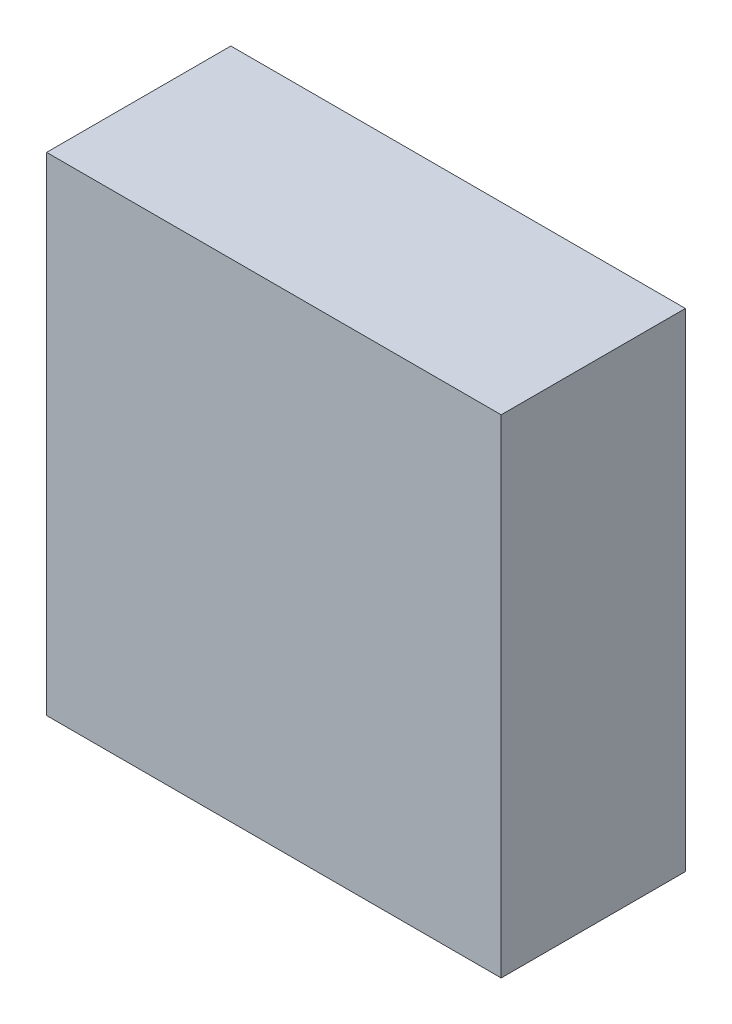
ISO-10303-21;
HEADER;
FILE_DESCRIPTION(('STEP AP214'),'2;1');
FILE_NAME('part.step','',(''),(''),'','','');
FILE_SCHEMA(('AUTOMOTIVE_DESIGN { 1 0 10303 214 1 1 1 1 }'));
ENDSEC;
DATA;
#1=APPLICATION_CONTEXT('core data for automotive mechanical design processes');
#2=APPLICATION_PROTOCOL_DEFINITION('international standard','automotive_design',2000,#1);
#3=PRODUCT_CONTEXT('',#1,'mechanical');
#4=PRODUCT('Part','Part','',(#3));
#5=PRODUCT_RELATED_PRODUCT_CATEGORY('part','',(#4));
#6=PRODUCT_DEFINITION_FORMATION('','',#4);
#7=PRODUCT_DEFINITION_CONTEXT('part definition',#1,'design');
#8=PRODUCT_DEFINITION('design','',#6,#7);
#9=PRODUCT_DEFINITION_SHAPE('','',#8);
#10=(LENGTH_UNIT() NAMED_UNIT(*) SI_UNIT(.MILLI.,.METRE.));
#11=(NAMED_UNIT(*) PLANE_ANGLE_UNIT() SI_UNIT($,.RADIAN.));
#12=(NAMED_UNIT(*) SI_UNIT($,.STERADIAN.) SOLID_ANGLE_UNIT());
#13=UNCERTAINTY_MEASURE_WITH_UNIT(LENGTH_MEASURE(1.E-05),#10,'distance_accuracy_value','');
#14=(GEOMETRIC_REPRESENTATION_CONTEXT(3) GLOBAL_UNCERTAINTY_ASSIGNED_CONTEXT((#13)) GLOBAL_UNIT_ASSIGNED_CONTEXT((#10,
#11,#12)) REPRESENTATION_CONTEXT('',''));
#15=CARTESIAN_POINT('',(0.,0.,0.));
#16=DIRECTION('',(0.,0.,1.));
#17=DIRECTION('',(1.,0.,0.));
#18=AXIS2_PLACEMENT_3D('',#15,#16,#17);
#19=CARTESIAN_POINT('',(-1.60000468291372,3.26999452572311,-4.61112093925476));
#20=DIRECTION('',(-1.,1.74845553146952E-07,0.));
#21=DIRECTION('',(-1.74845553146952E-07,-1.,0.));
#22=AXIS2_PLACEMENT_3D('',#19,#20,#21);
#23=PLANE('',#22);
#24=DIRECTION('',(-1.74845553137267E-07,-0.999999999999985,0.));
#25=VECTOR('',#24,1.);
#26=CARTESIAN_POINT('',(-1.60000468291372,3.26999452572311,-4.61112093925476));
#27=LINE('',#26,#25);
#28=CARTESIAN_POINT('',(-1.60000468291372,3.26999452572311,-4.61112093925476));
#29=VERTEX_POINT('',#28);
#30=CARTESIAN_POINT('',(-1.60000582640515,-3.27001401919877,-4.61112093925476));
#31=VERTEX_POINT('',#30);
#32=EDGE_CURVE('E11',#29,#31,#27,.T.);
#33=ORIENTED_EDGE('',*,*,#32,.T.);
#34=DIRECTION('',(0.,0.,1.));
#35=VECTOR('',#34,1.);
#36=CARTESIAN_POINT('',(-1.60000582640513,-3.27001401919877,-4.61112093925476));
#37=LINE('',#36,#35);
#38=CARTESIAN_POINT('',(-1.60000582640515,-3.27001401919877,-2.14112091064453));
#39=VERTEX_POINT('',#38);
#40=EDGE_CURVE('E88',#31,#39,#37,.T.);
#41=ORIENTED_EDGE('',*,*,#40,.T.);
#42=DIRECTION('',(-1.74845553137267E-07,-0.999999999999985,0.));
#43=VECTOR('',#42,1.);
#44=CARTESIAN_POINT('',(-1.60000468291372,3.26999452572311,-2.14112091064453));
#45=LINE('',#44,#43);
#46=CARTESIAN_POINT('',(-1.60000468291372,3.26999452572311,-2.14112091064453));
#47=VERTEX_POINT('',#46);
#48=EDGE_CURVE('E83',#47,#39,#45,.T.);
#49=ORIENTED_EDGE('',*,*,#48,.F.);
#50=DIRECTION('',(0.,0.,1.));
#51=VECTOR('',#50,1.);
#52=CARTESIAN_POINT('',(-1.60000468291372,3.26999452572311,-4.61112093925476));
#53=LINE('',#52,#51);
#54=EDGE_CURVE('E72',#29,#47,#53,.T.);
#55=ORIENTED_EDGE('',*,*,#54,.F.);
#56=EDGE_LOOP('',(#33,#41,#49,#55));
#57=FACE_BOUND('',#56,.T.);
#58=ADVANCED_FACE('F17',(#57),#23,.T.);
#59=CARTESIAN_POINT('',(-1.60000582640515,-3.27001401919877,-4.61112093925476));
#60=DIRECTION('',(-1.74845553146952E-07,-1.,0.));
#61=DIRECTION('',(1.,-1.74845553146952E-07,0.));
#62=AXIS2_PLACEMENT_3D('',#59,#60,#61);
#63=PLANE('',#62);
#64=DIRECTION('',(0.999999999999985,-1.74845553140261E-07,0.));
#65=VECTOR('',#64,1.);
#66=CARTESIAN_POINT('',(-1.60000582640515,-3.27001401919877,-4.61112093925476));
#67=LINE('',#66,#65);
#68=CARTESIAN_POINT('',(4.49499539429797,-3.27001508488263,-4.61112093925476));
#69=VERTEX_POINT('',#68);
#70=EDGE_CURVE('E24',#31,#69,#67,.T.);
#71=ORIENTED_EDGE('',*,*,#70,.T.);
#72=DIRECTION('',(0.,0.,1.));
#73=VECTOR('',#72,1.);
#74=CARTESIAN_POINT('',(4.49499539429797,-3.27001508488263,-4.61112093925476));
#75=LINE('',#74,#73);
#76=CARTESIAN_POINT('',(4.49499539429797,-3.27001508488263,-2.14112091064453));
#77=VERTEX_POINT('',#76);
#78=EDGE_CURVE('E85',#69,#77,#75,.T.);
#79=ORIENTED_EDGE('',*,*,#78,.T.);
#80=DIRECTION('',(0.999999999999985,-1.74845553140261E-07,0.));
#81=VECTOR('',#80,1.);
#82=CARTESIAN_POINT('',(-1.60000582640515,-3.27001401919877,-2.14112091064453));
#83=LINE('',#82,#81);
#84=EDGE_CURVE('E66',#39,#77,#83,.T.);
#85=ORIENTED_EDGE('',*,*,#84,.F.);
#86=ORIENTED_EDGE('',*,*,#40,.F.);
#87=EDGE_LOOP('',(#71,#79,#85,#86));
#88=FACE_BOUND('',#87,.T.);
#89=ADVANCED_FACE('F89',(#88),#63,.T.);
#90=CARTESIAN_POINT('',(4.49499539429797,-3.27001508488263,-4.61112093925476));
#91=DIRECTION('',(1.,-1.74845553146952E-07,0.));
#92=DIRECTION('',(1.74845553146952E-07,1.,0.));
#93=AXIS2_PLACEMENT_3D('',#90,#91,#92);
#94=PLANE('',#93);
#95=DIRECTION('',(1.74845553171219E-07,0.999999999999985,0.));
#96=VECTOR('',#95,1.);
#97=CARTESIAN_POINT('',(4.49499539429797,-3.27001508488263,-4.61112093925476));
#98=LINE('',#97,#96);
#99=CARTESIAN_POINT('',(4.4949965377894,3.26999346003925,-4.61112093925476));
#100=VERTEX_POINT('',#99);
#101=EDGE_CURVE('E62',#69,#100,#98,.T.);
#102=ORIENTED_EDGE('',*,*,#101,.T.);
#103=DIRECTION('',(0.,0.,1.));
#104=VECTOR('',#103,1.);
#105=CARTESIAN_POINT('',(4.49499653778939,3.26999346003925,-4.61112093925476));
#106=LINE('',#105,#104);
#107=CARTESIAN_POINT('',(4.4949965377894,3.26999346003925,-2.14112091064453));
#108=VERTEX_POINT('',#107);
#109=EDGE_CURVE('E55',#100,#108,#106,.T.);
#110=ORIENTED_EDGE('',*,*,#109,.T.);
#111=DIRECTION('',(1.74845553171219E-07,0.999999999999985,0.));
#112=VECTOR('',#111,1.);
#113=CARTESIAN_POINT('',(4.49499539429797,-3.27001508488263,-2.14112091064453));
#114=LINE('',#113,#112);
#115=EDGE_CURVE('E59',#77,#108,#114,.T.);
#116=ORIENTED_EDGE('',*,*,#115,.F.);
#117=ORIENTED_EDGE('',*,*,#78,.F.);
#118=EDGE_LOOP('',(#102,#110,#116,#117));
#119=FACE_BOUND('',#118,.T.);
#120=ADVANCED_FACE('F57',(#119),#94,.T.);
#121=CARTESIAN_POINT('',(4.4949965377894,3.26999346003925,-4.61112093925476));
#122=DIRECTION('',(1.74845553146952E-07,1.,0.));
#123=DIRECTION('',(-1.,1.74845553146952E-07,0.));
#124=AXIS2_PLACEMENT_3D('',#121,#122,#123);
#125=PLANE('',#124);
#126=DIRECTION('',(-0.999999999999985,1.74845553140261E-07,0.));
#127=VECTOR('',#126,1.);
#128=CARTESIAN_POINT('',(4.4949965377894,3.26999346003925,-4.61112093925476));
#129=LINE('',#128,#127);
#130=EDGE_CURVE('E65',#100,#29,#129,.T.);
#131=ORIENTED_EDGE('',*,*,#130,.T.);
#132=ORIENTED_EDGE('',*,*,#54,.T.);
#133=DIRECTION('',(-0.999999999999985,1.74845553140261E-07,0.));
#134=VECTOR('',#133,1.);
#135=CARTESIAN_POINT('',(4.4949965377894,3.26999346003925,-2.14112091064453));
#136=LINE('',#135,#134);
#137=EDGE_CURVE('E70',#108,#47,#136,.T.);
#138=ORIENTED_EDGE('',*,*,#137,.F.);
#139=ORIENTED_EDGE('',*,*,#109,.F.);
#140=EDGE_LOOP('',(#131,#132,#138,#139));
#141=FACE_BOUND('',#140,.T.);
#142=ADVANCED_FACE('F71',(#141),#125,.T.);
#143=CARTESIAN_POINT('',(-188.250015258789,-92.1249694824219,-2.14112091064453));
#144=DIRECTION('',(0.,0.,1.));
#145=DIRECTION('',(1.,-1.74845553146952E-07,0.));
#146=AXIS2_PLACEMENT_3D('',#143,#144,#145);
#147=PLANE('',#146);
#148=ORIENTED_EDGE('',*,*,#48,.T.);
#149=ORIENTED_EDGE('',*,*,#84,.T.);
#150=ORIENTED_EDGE('',*,*,#115,.T.);
#151=ORIENTED_EDGE('',*,*,#137,.T.);
#152=EDGE_LOOP('',(#148,#149,#150,#151));
#153=FACE_BOUND('',#152,.T.);
#154=ADVANCED_FACE('F76',(#153),#147,.T.);
#155=CARTESIAN_POINT('',(-188.250015258789,-92.1249694824219,-4.61112093925476));
#156=DIRECTION('',(0.,0.,1.));
#157=DIRECTION('',(1.,-1.74845553146952E-07,0.));
#158=AXIS2_PLACEMENT_3D('',#155,#156,#157);
#159=PLANE('',#158);
#160=ORIENTED_EDGE('',*,*,#130,.F.);
#161=ORIENTED_EDGE('',*,*,#101,.F.);
#162=ORIENTED_EDGE('',*,*,#70,.F.);
#163=ORIENTED_EDGE('',*,*,#32,.F.);
#164=EDGE_LOOP('',(#160,#161,#162,#163));
#165=FACE_BOUND('',#164,.T.);
#166=ADVANCED_FACE('F91',(#165),#159,.F.);
#167=CLOSED_SHELL('',(#58,#89,#120,#142,#154,#166));
#168=MANIFOLD_SOLID_BREP('B1',#167);
#169=ADVANCED_BREP_SHAPE_REPRESENTATION('',(#18,#168),#14);
#170=SHAPE_DEFINITION_REPRESENTATION(#9,#169);
ENDSEC;
END-ISO-10303-21;
